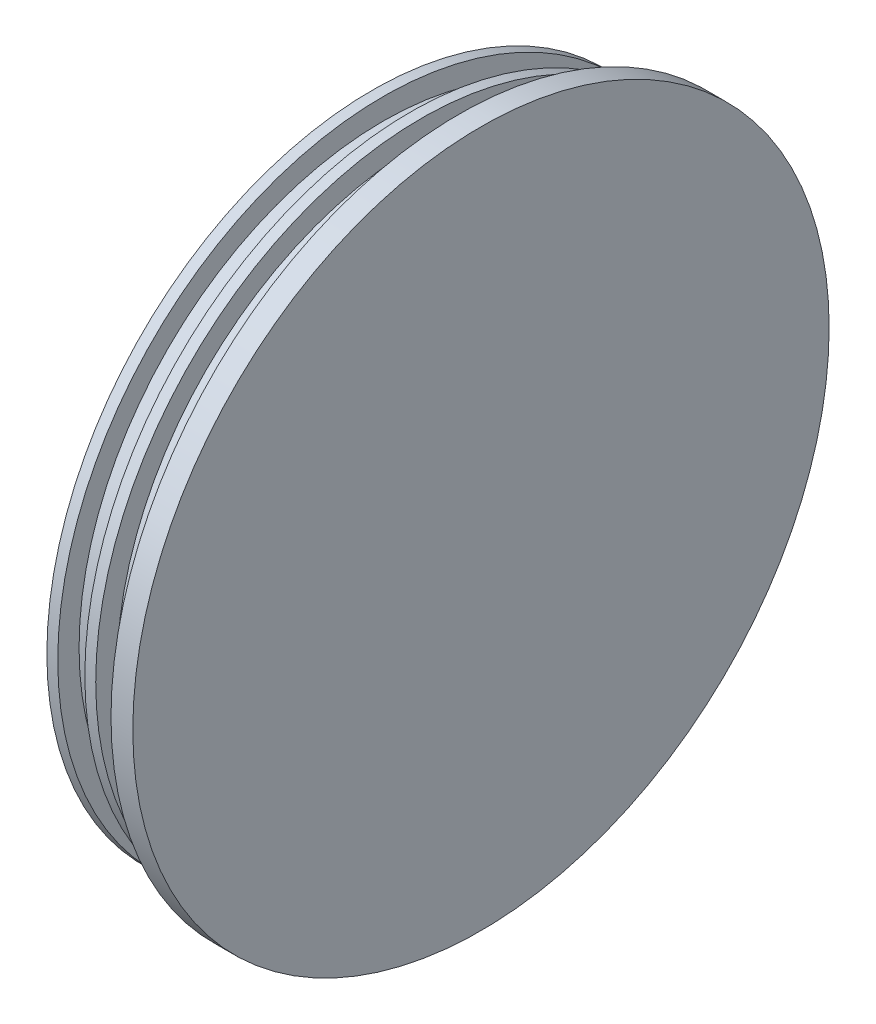
ISO-10303-21;
HEADER;
FILE_DESCRIPTION(('STEP AP214'),'2;1');
FILE_NAME('part.step','',(''),(''),'','','');
FILE_SCHEMA(('AUTOMOTIVE_DESIGN { 1 0 10303 214 1 1 1 1 }'));
ENDSEC;
DATA;
#1=APPLICATION_CONTEXT('core data for automotive mechanical design processes');
#2=APPLICATION_PROTOCOL_DEFINITION('international standard','automotive_design',2000,#1);
#3=PRODUCT_CONTEXT('',#1,'mechanical');
#4=PRODUCT('Part','Part','',(#3));
#5=PRODUCT_RELATED_PRODUCT_CATEGORY('part','',(#4));
#6=PRODUCT_DEFINITION_FORMATION('','',#4);
#7=PRODUCT_DEFINITION_CONTEXT('part definition',#1,'design');
#8=PRODUCT_DEFINITION('design','',#6,#7);
#9=PRODUCT_DEFINITION_SHAPE('','',#8);
#10=(LENGTH_UNIT() NAMED_UNIT(*) SI_UNIT(.MILLI.,.METRE.));
#11=(NAMED_UNIT(*) PLANE_ANGLE_UNIT() SI_UNIT($,.RADIAN.));
#12=(NAMED_UNIT(*) SI_UNIT($,.STERADIAN.) SOLID_ANGLE_UNIT());
#13=UNCERTAINTY_MEASURE_WITH_UNIT(LENGTH_MEASURE(1.E-05),#10,'distance_accuracy_value','');
#14=(GEOMETRIC_REPRESENTATION_CONTEXT(3) GLOBAL_UNCERTAINTY_ASSIGNED_CONTEXT((#13)) GLOBAL_UNIT_ASSIGNED_CONTEXT((#10,
#11,#12)) REPRESENTATION_CONTEXT('',''));
#15=CARTESIAN_POINT('',(0.,0.,0.));
#16=DIRECTION('',(0.,0.,1.));
#17=DIRECTION('',(1.,0.,0.));
#18=AXIS2_PLACEMENT_3D('',#15,#16,#17);
#19=CARTESIAN_POINT('',(0.,0.,0.));
#20=DIRECTION('',(-1.,0.,0.));
#21=DIRECTION('',(0.,0.,1.));
#22=AXIS2_PLACEMENT_3D('',#19,#20,#21);
#23=CYLINDRICAL_SURFACE('',#22,50.673);
#24=CARTESIAN_POINT('',(4.318,0.,0.));
#25=DIRECTION('',(-1.,0.,0.));
#26=DIRECTION('',(0.,0.,1.));
#27=AXIS2_PLACEMENT_3D('',#24,#25,#26);
#28=CIRCLE('',#27,50.673);
#29=CARTESIAN_POINT('',(4.318,0.,50.673));
#30=VERTEX_POINT('',#29);
#31=EDGE_CURVE('E11',#30,#30,#28,.T.);
#32=ORIENTED_EDGE('',*,*,#31,.F.);
#33=EDGE_LOOP('',(#32));
#34=FACE_BOUND('',#33,.T.);
#35=CARTESIAN_POINT('',(7.493,0.,0.));
#36=DIRECTION('',(-1.,0.,0.));
#37=DIRECTION('',(0.,0.,1.));
#38=AXIS2_PLACEMENT_3D('',#35,#36,#37);
#39=CIRCLE('',#38,50.673);
#40=CARTESIAN_POINT('',(7.493,0.,50.673));
#41=VERTEX_POINT('',#40);
#42=EDGE_CURVE('E90',#41,#41,#39,.T.);
#43=ORIENTED_EDGE('',*,*,#42,.T.);
#44=EDGE_LOOP('',(#43));
#45=FACE_BOUND('',#44,.T.);
#46=ADVANCED_FACE('F37',(#34,#45),#23,.T.);
#47=CARTESIAN_POINT('',(4.318,50.673,0.));
#48=DIRECTION('',(1.,0.,0.));
#49=DIRECTION('',(0.,0.,-1.));
#50=AXIS2_PLACEMENT_3D('',#47,#48,#49);
#51=PLANE('',#50);
#52=CARTESIAN_POINT('',(4.318,0.,0.));
#53=DIRECTION('',(-1.,0.,0.));
#54=DIRECTION('',(0.,0.,1.));
#55=AXIS2_PLACEMENT_3D('',#52,#53,#54);
#56=CIRCLE('',#55,47.371);
#57=CARTESIAN_POINT('',(4.318,0.,47.371));
#58=VERTEX_POINT('',#57);
#59=EDGE_CURVE('E44',#58,#58,#56,.T.);
#60=ORIENTED_EDGE('',*,*,#59,.F.);
#61=EDGE_LOOP('',(#60));
#62=FACE_BOUND('',#61,.T.);
#63=ORIENTED_EDGE('',*,*,#31,.T.);
#64=EDGE_LOOP('',(#63));
#65=FACE_BOUND('',#64,.T.);
#66=ADVANCED_FACE('F130',(#62,#65),#51,.F.);
#67=CARTESIAN_POINT('',(0.,0.,0.));
#68=DIRECTION('',(-1.,0.,0.));
#69=DIRECTION('',(0.,0.,1.));
#70=AXIS2_PLACEMENT_3D('',#67,#68,#69);
#71=CYLINDRICAL_SURFACE('',#70,47.371);
#72=CARTESIAN_POINT('',(2.7305,0.,0.));
#73=DIRECTION('',(-1.,0.,0.));
#74=DIRECTION('',(0.,0.,1.));
#75=AXIS2_PLACEMENT_3D('',#72,#73,#74);
#76=CIRCLE('',#75,47.371);
#77=CARTESIAN_POINT('',(2.7305,0.,47.371));
#78=VERTEX_POINT('',#77);
#79=EDGE_CURVE('E123',#78,#78,#76,.T.);
#80=ORIENTED_EDGE('',*,*,#79,.F.);
#81=EDGE_LOOP('',(#80));
#82=FACE_BOUND('',#81,.T.);
#83=ORIENTED_EDGE('',*,*,#59,.T.);
#84=EDGE_LOOP('',(#83));
#85=FACE_BOUND('',#84,.T.);
#86=ADVANCED_FACE('F128',(#82,#85),#71,.T.);
#87=CARTESIAN_POINT('',(2.7305,44.2722,0.));
#88=DIRECTION('',(1.,0.,0.));
#89=DIRECTION('',(0.,0.,-1.));
#90=AXIS2_PLACEMENT_3D('',#87,#88,#89);
#91=PLANE('',#90);
#92=CARTESIAN_POINT('',(2.7305,0.,0.));
#93=DIRECTION('',(-1.,0.,0.));
#94=DIRECTION('',(0.,0.,1.));
#95=AXIS2_PLACEMENT_3D('',#92,#93,#94);
#96=CIRCLE('',#95,44.2722);
#97=CARTESIAN_POINT('',(2.7305,0.,44.2722));
#98=VERTEX_POINT('',#97);
#99=EDGE_CURVE('E120',#98,#98,#96,.T.);
#100=ORIENTED_EDGE('',*,*,#99,.F.);
#101=EDGE_LOOP('',(#100));
#102=FACE_BOUND('',#101,.T.);
#103=ORIENTED_EDGE('',*,*,#79,.T.);
#104=EDGE_LOOP('',(#103));
#105=FACE_BOUND('',#104,.T.);
#106=ADVANCED_FACE('F189',(#102,#105),#91,.F.);
#107=CARTESIAN_POINT('',(0.,0.,0.));
#108=DIRECTION('',(-1.,0.,0.));
#109=DIRECTION('',(0.,0.,1.));
#110=AXIS2_PLACEMENT_3D('',#107,#108,#109);
#111=CYLINDRICAL_SURFACE('',#110,44.2722);
#112=CARTESIAN_POINT('',(-1.20649999999999,0.,0.));
#113=DIRECTION('',(-1.,0.,0.));
#114=DIRECTION('',(0.,0.,1.));
#115=AXIS2_PLACEMENT_3D('',#112,#113,#114);
#116=CIRCLE('',#115,44.2722);
#117=CARTESIAN_POINT('',(-1.20649999999999,0.,44.2722));
#118=VERTEX_POINT('',#117);
#119=EDGE_CURVE('E117',#118,#118,#116,.T.);
#120=ORIENTED_EDGE('',*,*,#119,.F.);
#121=EDGE_LOOP('',(#120));
#122=FACE_BOUND('',#121,.T.);
#123=ORIENTED_EDGE('',*,*,#99,.T.);
#124=EDGE_LOOP('',(#123));
#125=FACE_BOUND('',#124,.T.);
#126=ADVANCED_FACE('F185',(#122,#125),#111,.T.);
#127=CARTESIAN_POINT('',(-1.2065,47.371,0.));
#128=DIRECTION('',(-1.,0.,0.));
#129=DIRECTION('',(0.,0.,1.));
#130=AXIS2_PLACEMENT_3D('',#127,#128,#129);
#131=PLANE('',#130);
#132=CARTESIAN_POINT('',(-1.2065,0.,0.));
#133=DIRECTION('',(-1.,0.,0.));
#134=DIRECTION('',(0.,0.,1.));
#135=AXIS2_PLACEMENT_3D('',#132,#133,#134);
#136=CIRCLE('',#135,47.371);
#137=CARTESIAN_POINT('',(-1.2065,0.,47.371));
#138=VERTEX_POINT('',#137);
#139=EDGE_CURVE('E114',#138,#138,#136,.T.);
#140=ORIENTED_EDGE('',*,*,#139,.F.);
#141=EDGE_LOOP('',(#140));
#142=FACE_BOUND('',#141,.T.);
#143=ORIENTED_EDGE('',*,*,#119,.T.);
#144=EDGE_LOOP('',(#143));
#145=FACE_BOUND('',#144,.T.);
#146=ADVANCED_FACE('F181',(#142,#145),#131,.F.);
#147=CARTESIAN_POINT('',(0.,0.,0.));
#148=DIRECTION('',(-1.,0.,0.));
#149=DIRECTION('',(0.,0.,1.));
#150=AXIS2_PLACEMENT_3D('',#147,#148,#149);
#151=CYLINDRICAL_SURFACE('',#150,47.371);
#152=CARTESIAN_POINT('',(-2.79399999999999,0.,0.));
#153=DIRECTION('',(-1.,0.,0.));
#154=DIRECTION('',(0.,0.,1.));
#155=AXIS2_PLACEMENT_3D('',#152,#153,#154);
#156=CIRCLE('',#155,47.371);
#157=CARTESIAN_POINT('',(-2.79399999999999,0.,47.371));
#158=VERTEX_POINT('',#157);
#159=EDGE_CURVE('E111',#158,#158,#156,.T.);
#160=ORIENTED_EDGE('',*,*,#159,.F.);
#161=EDGE_LOOP('',(#160));
#162=FACE_BOUND('',#161,.T.);
#163=ORIENTED_EDGE('',*,*,#139,.T.);
#164=EDGE_LOOP('',(#163));
#165=FACE_BOUND('',#164,.T.);
#166=ADVANCED_FACE('F177',(#162,#165),#151,.T.);
#167=CARTESIAN_POINT('',(-2.79399999999999,44.2722,0.));
#168=DIRECTION('',(1.,0.,0.));
#169=DIRECTION('',(0.,0.,-1.));
#170=AXIS2_PLACEMENT_3D('',#167,#168,#169);
#171=PLANE('',#170);
#172=CARTESIAN_POINT('',(-2.794,0.,0.));
#173=DIRECTION('',(-1.,0.,0.));
#174=DIRECTION('',(0.,0.,1.));
#175=AXIS2_PLACEMENT_3D('',#172,#173,#174);
#176=CIRCLE('',#175,44.2722);
#177=CARTESIAN_POINT('',(-2.794,0.,44.2722));
#178=VERTEX_POINT('',#177);
#179=EDGE_CURVE('E108',#178,#178,#176,.T.);
#180=ORIENTED_EDGE('',*,*,#179,.F.);
#181=EDGE_LOOP('',(#180));
#182=FACE_BOUND('',#181,.T.);
#183=ORIENTED_EDGE('',*,*,#159,.T.);
#184=EDGE_LOOP('',(#183));
#185=FACE_BOUND('',#184,.T.);
#186=ADVANCED_FACE('F173',(#182,#185),#171,.F.);
#187=CARTESIAN_POINT('',(0.,0.,0.));
#188=DIRECTION('',(-1.,0.,0.));
#189=DIRECTION('',(0.,0.,1.));
#190=AXIS2_PLACEMENT_3D('',#187,#188,#189);
#191=CYLINDRICAL_SURFACE('',#190,44.2722);
#192=CARTESIAN_POINT('',(-6.73099999999999,0.,0.));
#193=DIRECTION('',(-1.,0.,0.));
#194=DIRECTION('',(0.,0.,1.));
#195=AXIS2_PLACEMENT_3D('',#192,#193,#194);
#196=CIRCLE('',#195,44.2722);
#197=CARTESIAN_POINT('',(-6.73099999999999,0.,44.2722));
#198=VERTEX_POINT('',#197);
#199=EDGE_CURVE('E105',#198,#198,#196,.T.);
#200=ORIENTED_EDGE('',*,*,#199,.F.);
#201=EDGE_LOOP('',(#200));
#202=FACE_BOUND('',#201,.T.);
#203=ORIENTED_EDGE('',*,*,#179,.T.);
#204=EDGE_LOOP('',(#203));
#205=FACE_BOUND('',#204,.T.);
#206=ADVANCED_FACE('F169',(#202,#205),#191,.T.);
#207=CARTESIAN_POINT('',(-6.73099999999999,47.371,0.));
#208=DIRECTION('',(-1.,0.,0.));
#209=DIRECTION('',(0.,0.,1.));
#210=AXIS2_PLACEMENT_3D('',#207,#208,#209);
#211=PLANE('',#210);
#212=CARTESIAN_POINT('',(-6.73099999999999,0.,0.));
#213=DIRECTION('',(-1.,0.,0.));
#214=DIRECTION('',(0.,0.,1.));
#215=AXIS2_PLACEMENT_3D('',#212,#213,#214);
#216=CIRCLE('',#215,47.371);
#217=CARTESIAN_POINT('',(-6.73099999999999,0.,47.371));
#218=VERTEX_POINT('',#217);
#219=EDGE_CURVE('E102',#218,#218,#216,.T.);
#220=ORIENTED_EDGE('',*,*,#219,.F.);
#221=EDGE_LOOP('',(#220));
#222=FACE_BOUND('',#221,.T.);
#223=ORIENTED_EDGE('',*,*,#199,.T.);
#224=EDGE_LOOP('',(#223));
#225=FACE_BOUND('',#224,.T.);
#226=ADVANCED_FACE('F165',(#222,#225),#211,.F.);
#227=CARTESIAN_POINT('',(0.,0.,0.));
#228=DIRECTION('',(-1.,0.,0.));
#229=DIRECTION('',(0.,0.,1.));
#230=AXIS2_PLACEMENT_3D('',#227,#228,#229);
#231=CYLINDRICAL_SURFACE('',#230,47.371);
#232=CARTESIAN_POINT('',(-8.31849999999999,0.,0.));
#233=DIRECTION('',(-1.,0.,0.));
#234=DIRECTION('',(0.,0.,1.));
#235=AXIS2_PLACEMENT_3D('',#232,#233,#234);
#236=CIRCLE('',#235,47.371);
#237=CARTESIAN_POINT('',(-8.31849999999999,0.,47.371));
#238=VERTEX_POINT('',#237);
#239=EDGE_CURVE('E99',#238,#238,#236,.T.);
#240=ORIENTED_EDGE('',*,*,#239,.F.);
#241=EDGE_LOOP('',(#240));
#242=FACE_BOUND('',#241,.T.);
#243=ORIENTED_EDGE('',*,*,#219,.T.);
#244=EDGE_LOOP('',(#243));
#245=FACE_BOUND('',#244,.T.);
#246=ADVANCED_FACE('F161',(#242,#245),#231,.T.);
#247=CARTESIAN_POINT('',(-8.31849999999999,47.371,0.));
#248=DIRECTION('',(1.,0.,0.));
#249=DIRECTION('',(0.,0.,-1.));
#250=AXIS2_PLACEMENT_3D('',#247,#248,#249);
#251=PLANE('',#250);
#252=CARTESIAN_POINT('',(-8.31849999999999,0.,0.));
#253=DIRECTION('',(-1.,0.,0.));
#254=DIRECTION('',(0.,0.,1.));
#255=AXIS2_PLACEMENT_3D('',#252,#253,#254);
#256=CIRCLE('',#255,41.0972);
#257=CARTESIAN_POINT('',(-8.31849999999999,0.,41.0972));
#258=VERTEX_POINT('',#257);
#259=EDGE_CURVE('E96',#258,#258,#256,.T.);
#260=ORIENTED_EDGE('',*,*,#259,.F.);
#261=EDGE_LOOP('',(#260));
#262=FACE_BOUND('',#261,.T.);
#263=ORIENTED_EDGE('',*,*,#239,.T.);
#264=EDGE_LOOP('',(#263));
#265=FACE_BOUND('',#264,.T.);
#266=ADVANCED_FACE('F157',(#262,#265),#251,.F.);
#267=CARTESIAN_POINT('',(0.,0.,0.));
#268=DIRECTION('',(-1.,0.,0.));
#269=DIRECTION('',(0.,0.,1.));
#270=AXIS2_PLACEMENT_3D('',#267,#268,#269);
#271=CYLINDRICAL_SURFACE('',#270,41.0972);
#272=CARTESIAN_POINT('',(0.,0.,0.));
#273=DIRECTION('',(-1.,0.,0.));
#274=DIRECTION('',(0.,0.,1.));
#275=AXIS2_PLACEMENT_3D('',#272,#273,#274);
#276=CIRCLE('',#275,41.0972);
#277=CARTESIAN_POINT('',(0.,0.,41.0972));
#278=VERTEX_POINT('',#277);
#279=EDGE_CURVE('E93',#278,#278,#276,.T.);
#280=ORIENTED_EDGE('',*,*,#279,.F.);
#281=EDGE_LOOP('',(#280));
#282=FACE_BOUND('',#281,.T.);
#283=ORIENTED_EDGE('',*,*,#259,.T.);
#284=EDGE_LOOP('',(#283));
#285=FACE_BOUND('',#284,.T.);
#286=ADVANCED_FACE('F150',(#282,#285),#271,.F.);
#287=CARTESIAN_POINT('',(0.,41.0972,0.));
#288=DIRECTION('',(1.,0.,0.));
#289=DIRECTION('',(0.,0.,-1.));
#290=AXIS2_PLACEMENT_3D('',#287,#288,#289);
#291=PLANE('',#290);
#292=CARTESIAN_POINT('',(0.,9.779,0.));
#293=DIRECTION('',(-1.,0.,0.));
#294=DIRECTION('',(0.,0.,1.));
#295=AXIS2_PLACEMENT_3D('',#292,#293,#294);
#296=CIRCLE('',#295,1.35255);
#297=CARTESIAN_POINT('',(0.,9.779,1.35255));
#298=VERTEX_POINT('',#297);
#299=EDGE_CURVE('E68',#298,#298,#296,.T.);
#300=ORIENTED_EDGE('',*,*,#299,.F.);
#301=EDGE_LOOP('',(#300));
#302=FACE_BOUND('',#301,.T.);
#303=CARTESIAN_POINT('',(0.,-9.779,0.));
#304=DIRECTION('',(-1.,0.,0.));
#305=DIRECTION('',(0.,0.,1.));
#306=AXIS2_PLACEMENT_3D('',#303,#304,#305);
#307=CIRCLE('',#306,1.35255);
#308=CARTESIAN_POINT('',(0.,-9.779,1.35255));
#309=VERTEX_POINT('',#308);
#310=EDGE_CURVE('E67',#309,#309,#307,.T.);
#311=ORIENTED_EDGE('',*,*,#310,.F.);
#312=EDGE_LOOP('',(#311));
#313=FACE_BOUND('',#312,.T.);
#314=CARTESIAN_POINT('',(0.,0.,-9.779));
#315=DIRECTION('',(-1.,0.,0.));
#316=DIRECTION('',(0.,0.,1.));
#317=AXIS2_PLACEMENT_3D('',#314,#315,#316);
#318=CIRCLE('',#317,1.35255);
#319=CARTESIAN_POINT('',(0.,0.,-8.42645));
#320=VERTEX_POINT('',#319);
#321=EDGE_CURVE('E78',#320,#320,#318,.T.);
#322=ORIENTED_EDGE('',*,*,#321,.F.);
#323=EDGE_LOOP('',(#322));
#324=FACE_BOUND('',#323,.T.);
#325=CARTESIAN_POINT('',(0.,0.,9.779));
#326=DIRECTION('',(-1.,0.,0.));
#327=DIRECTION('',(0.,0.,1.));
#328=AXIS2_PLACEMENT_3D('',#325,#326,#327);
#329=CIRCLE('',#328,1.35255);
#330=CARTESIAN_POINT('',(0.,0.,11.13155));
#331=VERTEX_POINT('',#330);
#332=EDGE_CURVE('E84',#331,#331,#329,.T.);
#333=ORIENTED_EDGE('',*,*,#332,.F.);
#334=EDGE_LOOP('',(#333));
#335=FACE_BOUND('',#334,.T.);
#336=ORIENTED_EDGE('',*,*,#279,.T.);
#337=EDGE_LOOP('',(#336));
#338=FACE_BOUND('',#337,.T.);
#339=ADVANCED_FACE('F142',(#302,#313,#324,#335,#338),#291,.F.);
#340=CARTESIAN_POINT('',(7.493,0.,0.));
#341=DIRECTION('',(-1.,0.,0.));
#342=DIRECTION('',(0.,0.,1.));
#343=AXIS2_PLACEMENT_3D('',#340,#341,#342);
#344=PLANE('',#343);
#345=ORIENTED_EDGE('',*,*,#42,.F.);
#346=EDGE_LOOP('',(#345));
#347=FACE_BOUND('',#346,.T.);
#348=ADVANCED_FACE('F139',(#347),#344,.F.);
#349=CARTESIAN_POINT('',(4.318,0.,9.779));
#350=DIRECTION('',(-1.,0.,0.));
#351=DIRECTION('',(0.,0.,1.));
#352=AXIS2_PLACEMENT_3D('',#349,#350,#351);
#353=CONICAL_SURFACE('',#352,1.35255,1.02974425867665);
#354=CARTESIAN_POINT('',(5.13069403026573,0.,9.779));
#355=VERTEX_POINT('',#354);
#356=VERTEX_LOOP('',#355);
#357=FACE_BOUND('',#356,.T.);
#358=CARTESIAN_POINT('',(4.318,0.,9.779));
#359=DIRECTION('',(-1.,0.,0.));
#360=DIRECTION('',(0.,0.,1.));
#361=AXIS2_PLACEMENT_3D('',#358,#359,#360);
#362=CIRCLE('',#361,1.35255);
#363=CARTESIAN_POINT('',(4.318,0.,11.13155));
#364=VERTEX_POINT('',#363);
#365=EDGE_CURVE('E87',#364,#364,#362,.T.);
#366=ORIENTED_EDGE('',*,*,#365,.T.);
#367=EDGE_LOOP('',(#366));
#368=FACE_BOUND('',#367,.T.);
#369=ADVANCED_FACE('F141',(#357,#368),#353,.F.);
#370=CARTESIAN_POINT('',(0.,0.,9.779));
#371=DIRECTION('',(-1.,0.,0.));
#372=DIRECTION('',(0.,0.,1.));
#373=AXIS2_PLACEMENT_3D('',#370,#371,#372);
#374=CYLINDRICAL_SURFACE('',#373,1.35255);
#375=ORIENTED_EDGE('',*,*,#365,.F.);
#376=EDGE_LOOP('',(#375));
#377=FACE_BOUND('',#376,.T.);
#378=ORIENTED_EDGE('',*,*,#332,.T.);
#379=EDGE_LOOP('',(#378));
#380=FACE_BOUND('',#379,.T.);
#381=ADVANCED_FACE('F148',(#377,#380),#374,.F.);
#382=CARTESIAN_POINT('',(4.318,0.,-9.779));
#383=DIRECTION('',(-1.,0.,0.));
#384=DIRECTION('',(0.,0.,1.));
#385=AXIS2_PLACEMENT_3D('',#382,#383,#384);
#386=CONICAL_SURFACE('',#385,1.35255,1.02974425867665);
#387=CARTESIAN_POINT('',(5.13069403026573,0.,-9.779));
#388=VERTEX_POINT('',#387);
#389=VERTEX_LOOP('',#388);
#390=FACE_BOUND('',#389,.T.);
#391=CARTESIAN_POINT('',(4.318,0.,-9.779));
#392=DIRECTION('',(-1.,0.,0.));
#393=DIRECTION('',(0.,0.,1.));
#394=AXIS2_PLACEMENT_3D('',#391,#392,#393);
#395=CIRCLE('',#394,1.35255);
#396=CARTESIAN_POINT('',(4.318,0.,-8.42645000000001));
#397=VERTEX_POINT('',#396);
#398=EDGE_CURVE('E81',#397,#397,#395,.T.);
#399=ORIENTED_EDGE('',*,*,#398,.T.);
#400=EDGE_LOOP('',(#399));
#401=FACE_BOUND('',#400,.T.);
#402=ADVANCED_FACE('F263',(#390,#401),#386,.F.);
#403=CARTESIAN_POINT('',(0.,0.,-9.779));
#404=DIRECTION('',(-1.,0.,0.));
#405=DIRECTION('',(0.,0.,1.));
#406=AXIS2_PLACEMENT_3D('',#403,#404,#405);
#407=CYLINDRICAL_SURFACE('',#406,1.35255);
#408=ORIENTED_EDGE('',*,*,#398,.F.);
#409=EDGE_LOOP('',(#408));
#410=FACE_BOUND('',#409,.T.);
#411=ORIENTED_EDGE('',*,*,#321,.T.);
#412=EDGE_LOOP('',(#411));
#413=FACE_BOUND('',#412,.T.);
#414=ADVANCED_FACE('F272',(#410,#413),#407,.F.);
#415=CARTESIAN_POINT('',(4.318,-9.779,0.));
#416=DIRECTION('',(-1.,0.,0.));
#417=DIRECTION('',(0.,0.,1.));
#418=AXIS2_PLACEMENT_3D('',#415,#416,#417);
#419=CONICAL_SURFACE('',#418,1.35255,1.02974425867665);
#420=CARTESIAN_POINT('',(5.13069403026573,-9.77900000000001,0.));
#421=VERTEX_POINT('',#420);
#422=VERTEX_LOOP('',#421);
#423=FACE_BOUND('',#422,.T.);
#424=CARTESIAN_POINT('',(4.318,-9.779,0.));
#425=DIRECTION('',(-1.,0.,0.));
#426=DIRECTION('',(0.,0.,1.));
#427=AXIS2_PLACEMENT_3D('',#424,#425,#426);
#428=CIRCLE('',#427,1.35255);
#429=CARTESIAN_POINT('',(4.318,-9.779,1.35255));
#430=VERTEX_POINT('',#429);
#431=EDGE_CURVE('E71',#430,#430,#428,.T.);
#432=ORIENTED_EDGE('',*,*,#431,.T.);
#433=EDGE_LOOP('',(#432));
#434=FACE_BOUND('',#433,.T.);
#435=ADVANCED_FACE('F281',(#423,#434),#419,.F.);
#436=CARTESIAN_POINT('',(0.,-9.779,0.));
#437=DIRECTION('',(-1.,0.,0.));
#438=DIRECTION('',(0.,0.,1.));
#439=AXIS2_PLACEMENT_3D('',#436,#437,#438);
#440=CYLINDRICAL_SURFACE('',#439,1.35255);
#441=ORIENTED_EDGE('',*,*,#431,.F.);
#442=EDGE_LOOP('',(#441));
#443=FACE_BOUND('',#442,.T.);
#444=ORIENTED_EDGE('',*,*,#310,.T.);
#445=EDGE_LOOP('',(#444));
#446=FACE_BOUND('',#445,.T.);
#447=ADVANCED_FACE('F61',(#443,#446),#440,.F.);
#448=CARTESIAN_POINT('',(4.318,9.779,0.));
#449=DIRECTION('',(-1.,0.,0.));
#450=DIRECTION('',(0.,0.,1.));
#451=AXIS2_PLACEMENT_3D('',#448,#449,#450);
#452=CONICAL_SURFACE('',#451,1.35255,1.02974425867665);
#453=CARTESIAN_POINT('',(5.13069403026573,9.779,0.));
#454=VERTEX_POINT('',#453);
#455=VERTEX_LOOP('',#454);
#456=FACE_BOUND('',#455,.T.);
#457=CARTESIAN_POINT('',(4.318,9.779,0.));
#458=DIRECTION('',(-1.,0.,0.));
#459=DIRECTION('',(0.,0.,1.));
#460=AXIS2_PLACEMENT_3D('',#457,#458,#459);
#461=CIRCLE('',#460,1.35255);
#462=CARTESIAN_POINT('',(4.318,9.779,1.35255));
#463=VERTEX_POINT('',#462);
#464=EDGE_CURVE('E65',#463,#463,#461,.T.);
#465=ORIENTED_EDGE('',*,*,#464,.T.);
#466=EDGE_LOOP('',(#465));
#467=FACE_BOUND('',#466,.T.);
#468=ADVANCED_FACE('F57',(#456,#467),#452,.F.);
#469=CARTESIAN_POINT('',(0.,9.779,0.));
#470=DIRECTION('',(-1.,0.,0.));
#471=DIRECTION('',(0.,0.,1.));
#472=AXIS2_PLACEMENT_3D('',#469,#470,#471);
#473=CYLINDRICAL_SURFACE('',#472,1.35255);
#474=ORIENTED_EDGE('',*,*,#464,.F.);
#475=EDGE_LOOP('',(#474));
#476=FACE_BOUND('',#475,.T.);
#477=ORIENTED_EDGE('',*,*,#299,.T.);
#478=EDGE_LOOP('',(#477));
#479=FACE_BOUND('',#478,.T.);
#480=ADVANCED_FACE('F60',(#476,#479),#473,.F.);
#481=CLOSED_SHELL('',(#46,#66,#86,#106,#126,#146,#166,#186,#206,#226,#246,#266,#286,#339,#348,
#369,#381,#402,#414,#435,#447,#468,#480));
#482=MANIFOLD_SOLID_BREP('B2',#481);
#483=ADVANCED_BREP_SHAPE_REPRESENTATION('',(#18,#482),#14);
#484=SHAPE_DEFINITION_REPRESENTATION(#9,#483);
ENDSEC;
END-ISO-10303-21;
